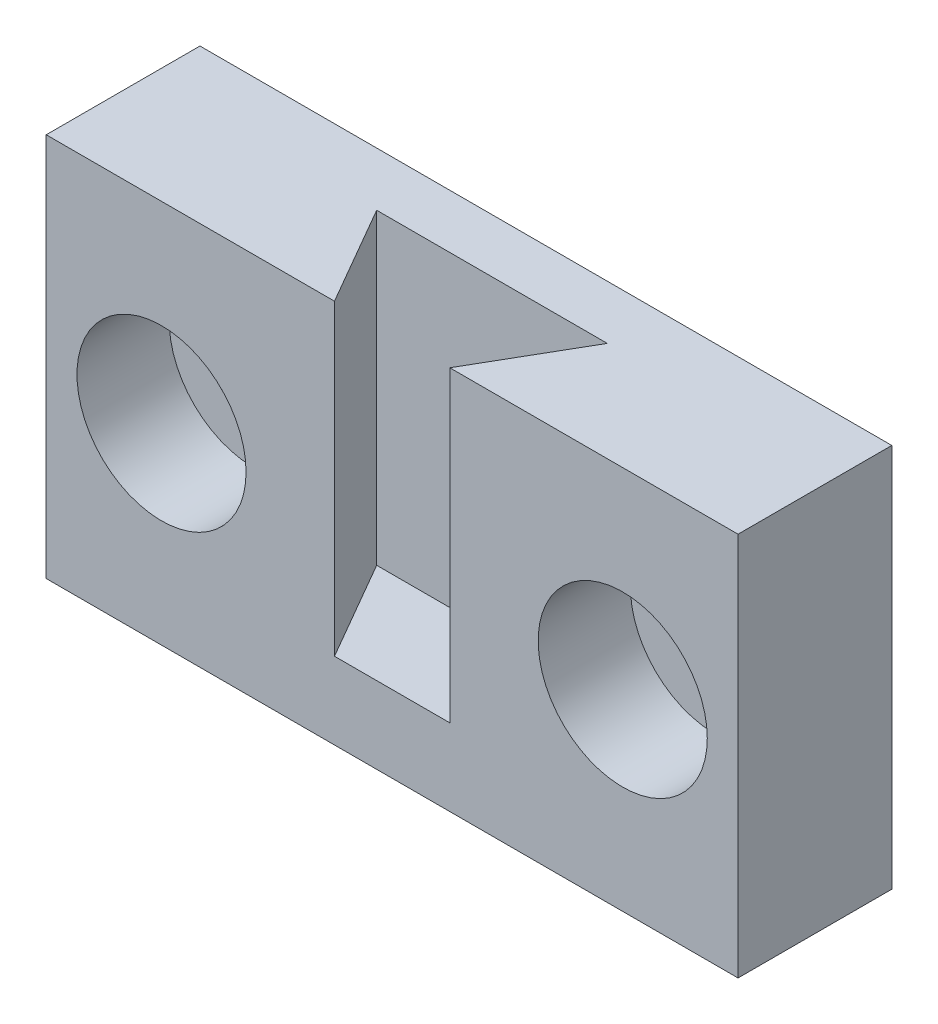
ISO-10303-21;
HEADER;
FILE_DESCRIPTION(('STEP AP214'),'2;1');
FILE_NAME('part.step','',(''),(''),'','','');
FILE_SCHEMA(('AUTOMOTIVE_DESIGN { 1 0 10303 214 1 1 1 1 }'));
ENDSEC;
DATA;
#1=APPLICATION_CONTEXT('core data for automotive mechanical design processes');
#2=APPLICATION_PROTOCOL_DEFINITION('international standard','automotive_design',2000,#1);
#3=PRODUCT_CONTEXT('',#1,'mechanical');
#4=PRODUCT('Part','Part','',(#3));
#5=PRODUCT_RELATED_PRODUCT_CATEGORY('part','',(#4));
#6=PRODUCT_DEFINITION_FORMATION('','',#4);
#7=PRODUCT_DEFINITION_CONTEXT('part definition',#1,'design');
#8=PRODUCT_DEFINITION('design','',#6,#7);
#9=PRODUCT_DEFINITION_SHAPE('','',#8);
#10=(LENGTH_UNIT() NAMED_UNIT(*) SI_UNIT(.MILLI.,.METRE.));
#11=(NAMED_UNIT(*) PLANE_ANGLE_UNIT() SI_UNIT($,.RADIAN.));
#12=(NAMED_UNIT(*) SI_UNIT($,.STERADIAN.) SOLID_ANGLE_UNIT());
#13=UNCERTAINTY_MEASURE_WITH_UNIT(LENGTH_MEASURE(1.E-05),#10,'distance_accuracy_value','');
#14=(GEOMETRIC_REPRESENTATION_CONTEXT(3) GLOBAL_UNCERTAINTY_ASSIGNED_CONTEXT((#13)) GLOBAL_UNIT_ASSIGNED_CONTEXT((#10,
#11,#12)) REPRESENTATION_CONTEXT('',''));
#15=CARTESIAN_POINT('',(0.,0.,0.));
#16=DIRECTION('',(0.,0.,1.));
#17=DIRECTION('',(1.,0.,0.));
#18=AXIS2_PLACEMENT_3D('',#15,#16,#17);
#19=CARTESIAN_POINT('',(-3.,10.,1.40192378864671));
#20=DIRECTION('',(-0.866025403784436,0.,0.500000000000005));
#21=DIRECTION('',(0.500000000000005,0.,0.866025403784436));
#22=AXIS2_PLACEMENT_3D('',#19,#20,#21);
#23=PLANE('',#22);
#24=DIRECTION('',(-0.500000000000005,0.,-0.866025403784436));
#25=VECTOR('',#24,1.);
#26=CARTESIAN_POINT('',(-3.,2.,1.40192378864671));
#27=LINE('',#26,#25);
#28=CARTESIAN_POINT('',(-1.5,2.,4.));
#29=VERTEX_POINT('',#28);
#30=CARTESIAN_POINT('',(-3.,2.,1.40192378864671));
#31=VERTEX_POINT('',#30);
#32=EDGE_CURVE('E53',#29,#31,#27,.T.);
#33=ORIENTED_EDGE('',*,*,#32,.T.);
#34=DIRECTION('',(0.,-1.,0.));
#35=VECTOR('',#34,1.);
#36=CARTESIAN_POINT('',(-3.,10.,1.40192378864671));
#37=LINE('',#36,#35);
#38=CARTESIAN_POINT('',(-3.,10.,1.40192378864671));
#39=VERTEX_POINT('',#38);
#40=EDGE_CURVE('E147',#39,#31,#37,.T.);
#41=ORIENTED_EDGE('',*,*,#40,.F.);
#42=DIRECTION('',(-0.500000000000005,0.,-0.866025403784436));
#43=VECTOR('',#42,1.);
#44=CARTESIAN_POINT('',(-3.,10.,1.40192378864671));
#45=LINE('',#44,#43);
#46=CARTESIAN_POINT('',(-1.5,10.,4.));
#47=VERTEX_POINT('',#46);
#48=EDGE_CURVE('E104',#47,#39,#45,.T.);
#49=ORIENTED_EDGE('',*,*,#48,.F.);
#50=DIRECTION('',(0.,-1.,0.));
#51=VECTOR('',#50,1.);
#52=CARTESIAN_POINT('',(-1.5,10.,4.));
#53=LINE('',#52,#51);
#54=EDGE_CURVE('E43',#47,#29,#53,.T.);
#55=ORIENTED_EDGE('',*,*,#54,.T.);
#56=EDGE_LOOP('',(#33,#41,#49,#55));
#57=FACE_BOUND('',#56,.T.);
#58=ADVANCED_FACE('F35',(#57),#23,.F.);
#59=CARTESIAN_POINT('',(3.,10.,1.40192378864671));
#60=DIRECTION('',(0.,0.,-1.));
#61=DIRECTION('',(-1.,0.,0.));
#62=AXIS2_PLACEMENT_3D('',#59,#60,#61);
#63=PLANE('',#62);
#64=DIRECTION('',(-1.,0.,0.));
#65=VECTOR('',#64,1.);
#66=CARTESIAN_POINT('',(3.,2.,1.40192378864671));
#67=LINE('',#66,#65);
#68=CARTESIAN_POINT('',(3.,2.,1.40192378864671));
#69=VERTEX_POINT('',#68);
#70=EDGE_CURVE('E122',#69,#31,#67,.T.);
#71=ORIENTED_EDGE('',*,*,#70,.F.);
#72=DIRECTION('',(0.,-1.,0.));
#73=VECTOR('',#72,1.);
#74=CARTESIAN_POINT('',(3.,10.,1.40192378864671));
#75=LINE('',#74,#73);
#76=CARTESIAN_POINT('',(3.,10.,1.40192378864671));
#77=VERTEX_POINT('',#76);
#78=EDGE_CURVE('E144',#77,#69,#75,.T.);
#79=ORIENTED_EDGE('',*,*,#78,.F.);
#80=DIRECTION('',(1.,0.,0.));
#81=VECTOR('',#80,1.);
#82=CARTESIAN_POINT('',(3.,10.,1.40192378864671));
#83=LINE('',#82,#81);
#84=EDGE_CURVE('E152',#39,#77,#83,.T.);
#85=ORIENTED_EDGE('',*,*,#84,.F.);
#86=ORIENTED_EDGE('',*,*,#40,.T.);
#87=EDGE_LOOP('',(#71,#79,#85,#86));
#88=FACE_BOUND('',#87,.T.);
#89=ADVANCED_FACE('F150',(#88),#63,.F.);
#90=CARTESIAN_POINT('',(1.5,10.,4.));
#91=DIRECTION('',(0.866025403784436,0.,0.500000000000004));
#92=DIRECTION('',(0.500000000000004,0.,-0.866025403784436));
#93=AXIS2_PLACEMENT_3D('',#90,#91,#92);
#94=PLANE('',#93);
#95=DIRECTION('',(-0.500000000000004,0.,0.866025403784436));
#96=VECTOR('',#95,1.);
#97=CARTESIAN_POINT('',(1.5,2.,4.));
#98=LINE('',#97,#96);
#99=CARTESIAN_POINT('',(1.5,2.,4.));
#100=VERTEX_POINT('',#99);
#101=EDGE_CURVE('E157',#69,#100,#98,.T.);
#102=ORIENTED_EDGE('',*,*,#101,.T.);
#103=DIRECTION('',(0.,-1.,0.));
#104=VECTOR('',#103,1.);
#105=CARTESIAN_POINT('',(1.5,10.,4.));
#106=LINE('',#105,#104);
#107=CARTESIAN_POINT('',(1.5,10.,4.));
#108=VERTEX_POINT('',#107);
#109=EDGE_CURVE('E141',#108,#100,#106,.T.);
#110=ORIENTED_EDGE('',*,*,#109,.F.);
#111=DIRECTION('',(-0.500000000000004,0.,0.866025403784436));
#112=VECTOR('',#111,1.);
#113=CARTESIAN_POINT('',(1.5,10.,4.));
#114=LINE('',#113,#112);
#115=EDGE_CURVE('E168',#77,#108,#114,.T.);
#116=ORIENTED_EDGE('',*,*,#115,.F.);
#117=ORIENTED_EDGE('',*,*,#78,.T.);
#118=EDGE_LOOP('',(#102,#110,#116,#117));
#119=FACE_BOUND('',#118,.T.);
#120=ADVANCED_FACE('F183',(#119),#94,.F.);
#121=CARTESIAN_POINT('',(-9.,10.,4.));
#122=DIRECTION('',(1.,0.,0.));
#123=DIRECTION('',(0.,0.,-1.));
#124=AXIS2_PLACEMENT_3D('',#121,#122,#123);
#125=PLANE('',#124);
#126=DIRECTION('',(0.,0.,1.));
#127=VECTOR('',#126,1.);
#128=CARTESIAN_POINT('',(-9.,0.,4.));
#129=LINE('',#128,#127);
#130=CARTESIAN_POINT('',(-9.,0.,0.));
#131=VERTEX_POINT('',#130);
#132=CARTESIAN_POINT('',(-9.,0.,4.));
#133=VERTEX_POINT('',#132);
#134=EDGE_CURVE('E117',#131,#133,#129,.T.);
#135=ORIENTED_EDGE('',*,*,#134,.T.);
#136=DIRECTION('',(0.,-1.,0.));
#137=VECTOR('',#136,1.);
#138=CARTESIAN_POINT('',(-9.,10.,4.));
#139=LINE('',#138,#137);
#140=CARTESIAN_POINT('',(-9.,10.,4.));
#141=VERTEX_POINT('',#140);
#142=EDGE_CURVE('E11',#141,#133,#139,.T.);
#143=ORIENTED_EDGE('',*,*,#142,.F.);
#144=DIRECTION('',(0.,0.,1.));
#145=VECTOR('',#144,1.);
#146=CARTESIAN_POINT('',(-9.,10.,4.));
#147=LINE('',#146,#145);
#148=CARTESIAN_POINT('',(-9.,10.,0.));
#149=VERTEX_POINT('',#148);
#150=EDGE_CURVE('E105',#149,#141,#147,.T.);
#151=ORIENTED_EDGE('',*,*,#150,.F.);
#152=DIRECTION('',(0.,-1.,0.));
#153=VECTOR('',#152,1.);
#154=CARTESIAN_POINT('',(-9.,10.,0.));
#155=LINE('',#154,#153);
#156=EDGE_CURVE('E118',#149,#131,#155,.T.);
#157=ORIENTED_EDGE('',*,*,#156,.T.);
#158=EDGE_LOOP('',(#135,#143,#151,#157));
#159=FACE_BOUND('',#158,.T.);
#160=ADVANCED_FACE('F37',(#159),#125,.F.);
#161=CARTESIAN_POINT('',(9.,10.,4.));
#162=DIRECTION('',(0.,0.,-1.));
#163=DIRECTION('',(-1.,0.,0.));
#164=AXIS2_PLACEMENT_3D('',#161,#162,#163);
#165=PLANE('',#164);
#166=CARTESIAN_POINT('',(-6.,5.,4.));
#167=DIRECTION('',(0.,0.,1.));
#168=DIRECTION('',(1.,0.,0.));
#169=AXIS2_PLACEMENT_3D('',#166,#167,#168);
#170=CIRCLE('',#169,2.19999999999999);
#171=CARTESIAN_POINT('',(-3.80000000000001,5.,4.));
#172=VERTEX_POINT('',#171);
#173=EDGE_CURVE('E237',#172,#172,#170,.T.);
#174=ORIENTED_EDGE('',*,*,#173,.F.);
#175=EDGE_LOOP('',(#174));
#176=FACE_BOUND('',#175,.T.);
#177=CARTESIAN_POINT('',(6.,5.,4.));
#178=DIRECTION('',(0.,0.,1.));
#179=DIRECTION('',(1.,0.,0.));
#180=AXIS2_PLACEMENT_3D('',#177,#178,#179);
#181=CIRCLE('',#180,2.19999999999999);
#182=CARTESIAN_POINT('',(8.2,5.,4.));
#183=VERTEX_POINT('',#182);
#184=EDGE_CURVE('E247',#183,#183,#181,.T.);
#185=ORIENTED_EDGE('',*,*,#184,.F.);
#186=EDGE_LOOP('',(#185));
#187=FACE_BOUND('',#186,.T.);
#188=DIRECTION('',(1.,0.,0.));
#189=VECTOR('',#188,1.);
#190=CARTESIAN_POINT('',(9.,0.,4.));
#191=LINE('',#190,#189);
#192=CARTESIAN_POINT('',(9.,0.,4.));
#193=VERTEX_POINT('',#192);
#194=EDGE_CURVE('E121',#133,#193,#191,.T.);
#195=ORIENTED_EDGE('',*,*,#194,.T.);
#196=DIRECTION('',(0.,-1.,0.));
#197=VECTOR('',#196,1.);
#198=CARTESIAN_POINT('',(9.,10.,4.));
#199=LINE('',#198,#197);
#200=CARTESIAN_POINT('',(9.,10.,4.));
#201=VERTEX_POINT('',#200);
#202=EDGE_CURVE('E138',#201,#193,#199,.T.);
#203=ORIENTED_EDGE('',*,*,#202,.F.);
#204=DIRECTION('',(1.,0.,0.));
#205=VECTOR('',#204,1.);
#206=CARTESIAN_POINT('',(9.,10.,4.));
#207=LINE('',#206,#205);
#208=EDGE_CURVE('E170',#108,#201,#207,.T.);
#209=ORIENTED_EDGE('',*,*,#208,.F.);
#210=ORIENTED_EDGE('',*,*,#109,.T.);
#211=DIRECTION('',(-1.,0.,0.));
#212=VECTOR('',#211,1.);
#213=CARTESIAN_POINT('',(-1.5,2.,4.));
#214=LINE('',#213,#212);
#215=EDGE_CURVE('E127',#100,#29,#214,.T.);
#216=ORIENTED_EDGE('',*,*,#215,.T.);
#217=ORIENTED_EDGE('',*,*,#54,.F.);
#218=DIRECTION('',(1.,0.,0.));
#219=VECTOR('',#218,1.);
#220=CARTESIAN_POINT('',(-1.5,10.,4.));
#221=LINE('',#220,#219);
#222=EDGE_CURVE('E97',#141,#47,#221,.T.);
#223=ORIENTED_EDGE('',*,*,#222,.F.);
#224=ORIENTED_EDGE('',*,*,#142,.T.);
#225=EDGE_LOOP('',(#195,#203,#209,#210,#216,#217,#223,#224));
#226=FACE_BOUND('',#225,.T.);
#227=ADVANCED_FACE('F99',(#176,#187,#226),#165,.F.);
#228=CARTESIAN_POINT('',(9.,10.,0.));
#229=DIRECTION('',(-1.,0.,0.));
#230=DIRECTION('',(0.,0.,1.));
#231=AXIS2_PLACEMENT_3D('',#228,#229,#230);
#232=PLANE('',#231);
#233=DIRECTION('',(0.,0.,-1.));
#234=VECTOR('',#233,1.);
#235=CARTESIAN_POINT('',(9.,0.,0.));
#236=LINE('',#235,#234);
#237=CARTESIAN_POINT('',(9.,0.,0.));
#238=VERTEX_POINT('',#237);
#239=EDGE_CURVE('E124',#193,#238,#236,.T.);
#240=ORIENTED_EDGE('',*,*,#239,.T.);
#241=DIRECTION('',(0.,-1.,0.));
#242=VECTOR('',#241,1.);
#243=CARTESIAN_POINT('',(9.,10.,0.));
#244=LINE('',#243,#242);
#245=CARTESIAN_POINT('',(9.,10.,0.));
#246=VERTEX_POINT('',#245);
#247=EDGE_CURVE('E135',#246,#238,#244,.T.);
#248=ORIENTED_EDGE('',*,*,#247,.F.);
#249=DIRECTION('',(0.,0.,-1.));
#250=VECTOR('',#249,1.);
#251=CARTESIAN_POINT('',(9.,10.,0.));
#252=LINE('',#251,#250);
#253=EDGE_CURVE('E171',#201,#246,#252,.T.);
#254=ORIENTED_EDGE('',*,*,#253,.F.);
#255=ORIENTED_EDGE('',*,*,#202,.T.);
#256=EDGE_LOOP('',(#240,#248,#254,#255));
#257=FACE_BOUND('',#256,.T.);
#258=ADVANCED_FACE('F177',(#257),#232,.F.);
#259=CARTESIAN_POINT('',(-9.,10.,0.));
#260=DIRECTION('',(0.,0.,1.));
#261=DIRECTION('',(1.,0.,0.));
#262=AXIS2_PLACEMENT_3D('',#259,#260,#261);
#263=PLANE('',#262);
#264=CARTESIAN_POINT('',(-6.,5.,0.));
#265=DIRECTION('',(0.,0.,1.));
#266=DIRECTION('',(1.,0.,0.));
#267=AXIS2_PLACEMENT_3D('',#264,#265,#266);
#268=CIRCLE('',#267,1.2);
#269=CARTESIAN_POINT('',(-4.8,5.,0.));
#270=VERTEX_POINT('',#269);
#271=EDGE_CURVE('E244',#270,#270,#268,.T.);
#272=ORIENTED_EDGE('',*,*,#271,.T.);
#273=EDGE_LOOP('',(#272));
#274=FACE_BOUND('',#273,.T.);
#275=CARTESIAN_POINT('',(6.,5.,0.));
#276=DIRECTION('',(0.,0.,1.));
#277=DIRECTION('',(1.,0.,0.));
#278=AXIS2_PLACEMENT_3D('',#275,#276,#277);
#279=CIRCLE('',#278,1.2);
#280=CARTESIAN_POINT('',(7.2,5.,0.));
#281=VERTEX_POINT('',#280);
#282=EDGE_CURVE('E162',#281,#281,#279,.T.);
#283=ORIENTED_EDGE('',*,*,#282,.T.);
#284=EDGE_LOOP('',(#283));
#285=FACE_BOUND('',#284,.T.);
#286=DIRECTION('',(-1.,0.,0.));
#287=VECTOR('',#286,1.);
#288=CARTESIAN_POINT('',(-9.,0.,0.));
#289=LINE('',#288,#287);
#290=EDGE_CURVE('E114',#238,#131,#289,.T.);
#291=ORIENTED_EDGE('',*,*,#290,.T.);
#292=ORIENTED_EDGE('',*,*,#156,.F.);
#293=DIRECTION('',(-1.,0.,0.));
#294=VECTOR('',#293,1.);
#295=CARTESIAN_POINT('',(-9.,10.,0.));
#296=LINE('',#295,#294);
#297=EDGE_CURVE('E110',#246,#149,#296,.T.);
#298=ORIENTED_EDGE('',*,*,#297,.F.);
#299=ORIENTED_EDGE('',*,*,#247,.T.);
#300=EDGE_LOOP('',(#291,#292,#298,#299));
#301=FACE_BOUND('',#300,.T.);
#302=ADVANCED_FACE('F180',(#274,#285,#301),#263,.F.);
#303=CARTESIAN_POINT('',(0.,10.,0.));
#304=DIRECTION('',(0.,-1.,0.));
#305=DIRECTION('',(0.,0.,-1.));
#306=AXIS2_PLACEMENT_3D('',#303,#304,#305);
#307=PLANE('',#306);
#308=ORIENTED_EDGE('',*,*,#150,.T.);
#309=ORIENTED_EDGE('',*,*,#222,.T.);
#310=ORIENTED_EDGE('',*,*,#48,.T.);
#311=ORIENTED_EDGE('',*,*,#84,.T.);
#312=ORIENTED_EDGE('',*,*,#115,.T.);
#313=ORIENTED_EDGE('',*,*,#208,.T.);
#314=ORIENTED_EDGE('',*,*,#253,.T.);
#315=ORIENTED_EDGE('',*,*,#297,.T.);
#316=EDGE_LOOP('',(#308,#309,#310,#311,#312,#313,#314,#315));
#317=FACE_BOUND('',#316,.T.);
#318=ADVANCED_FACE('F108',(#317),#307,.F.);
#319=CARTESIAN_POINT('',(0.,0.,0.));
#320=DIRECTION('',(0.,-1.,0.));
#321=DIRECTION('',(0.,0.,-1.));
#322=AXIS2_PLACEMENT_3D('',#319,#320,#321);
#323=PLANE('',#322);
#324=ORIENTED_EDGE('',*,*,#194,.F.);
#325=ORIENTED_EDGE('',*,*,#134,.F.);
#326=ORIENTED_EDGE('',*,*,#290,.F.);
#327=ORIENTED_EDGE('',*,*,#239,.F.);
#328=EDGE_LOOP('',(#324,#325,#326,#327));
#329=FACE_BOUND('',#328,.T.);
#330=ADVANCED_FACE('F181',(#329),#323,.T.);
#331=CARTESIAN_POINT('',(0.,2.,0.));
#332=DIRECTION('',(0.,-1.,0.));
#333=DIRECTION('',(0.,0.,-1.));
#334=AXIS2_PLACEMENT_3D('',#331,#332,#333);
#335=PLANE('',#334);
#336=ORIENTED_EDGE('',*,*,#101,.F.);
#337=ORIENTED_EDGE('',*,*,#70,.T.);
#338=ORIENTED_EDGE('',*,*,#32,.F.);
#339=ORIENTED_EDGE('',*,*,#215,.F.);
#340=EDGE_LOOP('',(#336,#337,#338,#339));
#341=FACE_BOUND('',#340,.T.);
#342=ADVANCED_FACE('F155',(#341),#335,.F.);
#343=CARTESIAN_POINT('',(6.,5.,4.));
#344=DIRECTION('',(0.,0.,1.));
#345=DIRECTION('',(1.,0.,0.));
#346=AXIS2_PLACEMENT_3D('',#343,#344,#345);
#347=CYLINDRICAL_SURFACE('',#346,1.2);
#348=ORIENTED_EDGE('',*,*,#282,.F.);
#349=EDGE_LOOP('',(#348));
#350=FACE_BOUND('',#349,.T.);
#351=CARTESIAN_POINT('',(6.,5.,1.6));
#352=DIRECTION('',(0.,0.,1.));
#353=DIRECTION('',(1.,0.,0.));
#354=AXIS2_PLACEMENT_3D('',#351,#352,#353);
#355=CIRCLE('',#354,1.2);
#356=CARTESIAN_POINT('',(7.2,5.,1.6));
#357=VERTEX_POINT('',#356);
#358=EDGE_CURVE('E253',#357,#357,#355,.T.);
#359=ORIENTED_EDGE('',*,*,#358,.T.);
#360=EDGE_LOOP('',(#359));
#361=FACE_BOUND('',#360,.T.);
#362=ADVANCED_FACE('F206',(#350,#361),#347,.F.);
#363=CARTESIAN_POINT('',(7.2,5.,1.6));
#364=DIRECTION('',(0.,0.,-1.));
#365=DIRECTION('',(-1.,0.,0.));
#366=AXIS2_PLACEMENT_3D('',#363,#364,#365);
#367=PLANE('',#366);
#368=ORIENTED_EDGE('',*,*,#358,.F.);
#369=EDGE_LOOP('',(#368));
#370=FACE_BOUND('',#369,.T.);
#371=CARTESIAN_POINT('',(6.,5.,1.6));
#372=DIRECTION('',(0.,0.,1.));
#373=DIRECTION('',(1.,0.,0.));
#374=AXIS2_PLACEMENT_3D('',#371,#372,#373);
#375=CIRCLE('',#374,2.2);
#376=CARTESIAN_POINT('',(8.2,5.,1.6));
#377=VERTEX_POINT('',#376);
#378=EDGE_CURVE('E250',#377,#377,#375,.T.);
#379=ORIENTED_EDGE('',*,*,#378,.T.);
#380=EDGE_LOOP('',(#379));
#381=FACE_BOUND('',#380,.T.);
#382=ADVANCED_FACE('F209',(#370,#381),#367,.F.);
#383=CARTESIAN_POINT('',(6.,5.,4.));
#384=DIRECTION('',(0.,0.,1.));
#385=DIRECTION('',(1.,0.,0.));
#386=AXIS2_PLACEMENT_3D('',#383,#384,#385);
#387=CYLINDRICAL_SURFACE('',#386,2.2);
#388=ORIENTED_EDGE('',*,*,#378,.F.);
#389=EDGE_LOOP('',(#388));
#390=FACE_BOUND('',#389,.T.);
#391=ORIENTED_EDGE('',*,*,#184,.T.);
#392=EDGE_LOOP('',(#391));
#393=FACE_BOUND('',#392,.T.);
#394=ADVANCED_FACE('F213',(#390,#393),#387,.F.);
#395=CARTESIAN_POINT('',(-6.,5.,4.));
#396=DIRECTION('',(0.,0.,1.));
#397=DIRECTION('',(1.,0.,0.));
#398=AXIS2_PLACEMENT_3D('',#395,#396,#397);
#399=CYLINDRICAL_SURFACE('',#398,1.2);
#400=ORIENTED_EDGE('',*,*,#271,.F.);
#401=EDGE_LOOP('',(#400));
#402=FACE_BOUND('',#401,.T.);
#403=CARTESIAN_POINT('',(-6.,5.,1.6));
#404=DIRECTION('',(0.,0.,1.));
#405=DIRECTION('',(1.,0.,0.));
#406=AXIS2_PLACEMENT_3D('',#403,#404,#405);
#407=CIRCLE('',#406,1.2);
#408=CARTESIAN_POINT('',(-4.8,5.,1.6));
#409=VERTEX_POINT('',#408);
#410=EDGE_CURVE('E239',#409,#409,#407,.T.);
#411=ORIENTED_EDGE('',*,*,#410,.T.);
#412=EDGE_LOOP('',(#411));
#413=FACE_BOUND('',#412,.T.);
#414=ADVANCED_FACE('F217',(#402,#413),#399,.F.);
#415=CARTESIAN_POINT('',(-4.8,5.,1.6));
#416=DIRECTION('',(0.,0.,-1.));
#417=DIRECTION('',(-1.,0.,0.));
#418=AXIS2_PLACEMENT_3D('',#415,#416,#417);
#419=PLANE('',#418);
#420=ORIENTED_EDGE('',*,*,#410,.F.);
#421=EDGE_LOOP('',(#420));
#422=FACE_BOUND('',#421,.T.);
#423=CARTESIAN_POINT('',(-6.,5.,1.6));
#424=DIRECTION('',(0.,0.,1.));
#425=DIRECTION('',(1.,0.,0.));
#426=AXIS2_PLACEMENT_3D('',#423,#424,#425);
#427=CIRCLE('',#426,2.2);
#428=CARTESIAN_POINT('',(-3.8,5.,1.6));
#429=VERTEX_POINT('',#428);
#430=EDGE_CURVE('E234',#429,#429,#427,.T.);
#431=ORIENTED_EDGE('',*,*,#430,.T.);
#432=EDGE_LOOP('',(#431));
#433=FACE_BOUND('',#432,.T.);
#434=ADVANCED_FACE('F221',(#422,#433),#419,.F.);
#435=CARTESIAN_POINT('',(-6.,5.,4.));
#436=DIRECTION('',(0.,0.,1.));
#437=DIRECTION('',(1.,0.,0.));
#438=AXIS2_PLACEMENT_3D('',#435,#436,#437);
#439=CYLINDRICAL_SURFACE('',#438,2.19999999999999);
#440=ORIENTED_EDGE('',*,*,#430,.F.);
#441=EDGE_LOOP('',(#440));
#442=FACE_BOUND('',#441,.T.);
#443=ORIENTED_EDGE('',*,*,#173,.T.);
#444=EDGE_LOOP('',(#443));
#445=FACE_BOUND('',#444,.T.);
#446=ADVANCED_FACE('F225',(#442,#445),#439,.F.);
#447=CLOSED_SHELL('',(#58,#89,#120,#160,#227,#258,#302,#318,#330,#342,#362,#382,#394,#414,#434,#446));
#448=MANIFOLD_SOLID_BREP('B2',#447);
#449=ADVANCED_BREP_SHAPE_REPRESENTATION('',(#18,#448),#14);
#450=SHAPE_DEFINITION_REPRESENTATION(#9,#449);
ENDSEC;
END-ISO-10303-21;
